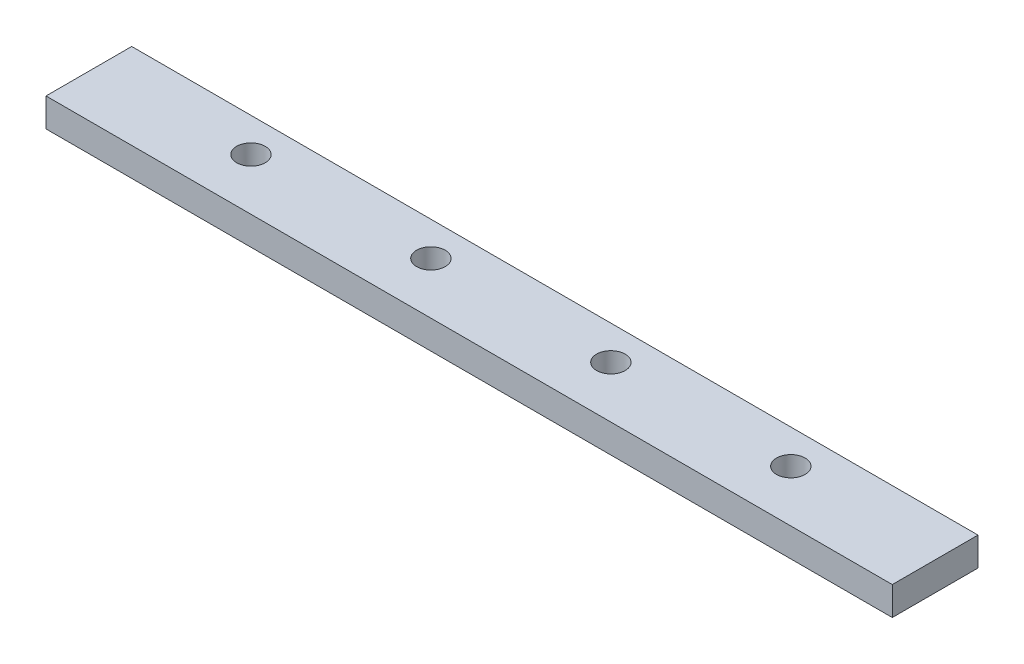
ISO-10303-21;
HEADER;
FILE_DESCRIPTION(('STEP AP214'),'2;1');
FILE_NAME('part.step','',(''),(''),'','','');
FILE_SCHEMA(('AUTOMOTIVE_DESIGN { 1 0 10303 214 1 1 1 1 }'));
ENDSEC;
DATA;
#1=APPLICATION_CONTEXT('core data for automotive mechanical design processes');
#2=APPLICATION_PROTOCOL_DEFINITION('international standard','automotive_design',2000,#1);
#3=PRODUCT_CONTEXT('',#1,'mechanical');
#4=PRODUCT('Part','Part','',(#3));
#5=PRODUCT_RELATED_PRODUCT_CATEGORY('part','',(#4));
#6=PRODUCT_DEFINITION_FORMATION('','',#4);
#7=PRODUCT_DEFINITION_CONTEXT('part definition',#1,'design');
#8=PRODUCT_DEFINITION('design','',#6,#7);
#9=PRODUCT_DEFINITION_SHAPE('','',#8);
#10=(LENGTH_UNIT() NAMED_UNIT(*) SI_UNIT(.MILLI.,.METRE.));
#11=(NAMED_UNIT(*) PLANE_ANGLE_UNIT() SI_UNIT($,.RADIAN.));
#12=(NAMED_UNIT(*) SI_UNIT($,.STERADIAN.) SOLID_ANGLE_UNIT());
#13=UNCERTAINTY_MEASURE_WITH_UNIT(LENGTH_MEASURE(1.E-05),#10,'distance_accuracy_value','');
#14=(GEOMETRIC_REPRESENTATION_CONTEXT(3) GLOBAL_UNCERTAINTY_ASSIGNED_CONTEXT((#13)) GLOBAL_UNIT_ASSIGNED_CONTEXT((#10,
#11,#12)) REPRESENTATION_CONTEXT('',''));
#15=CARTESIAN_POINT('',(0.,0.,0.));
#16=DIRECTION('',(0.,0.,1.));
#17=DIRECTION('',(1.,0.,0.));
#18=AXIS2_PLACEMENT_3D('',#15,#16,#17);
#19=CARTESIAN_POINT('',(376.2,0.,0.));
#20=DIRECTION('',(0.,0.,-1.));
#21=DIRECTION('',(-1.,0.,0.));
#22=AXIS2_PLACEMENT_3D('',#19,#20,#21);
#23=PLANE('',#22);
#24=DIRECTION('',(0.,-1.,0.));
#25=VECTOR('',#24,1.);
#26=CARTESIAN_POINT('',(0.,0.,0.));
#27=LINE('',#26,#25);
#28=CARTESIAN_POINT('',(0.,12.7,0.));
#29=VERTEX_POINT('',#28);
#30=CARTESIAN_POINT('',(0.,0.,0.));
#31=VERTEX_POINT('',#30);
#32=EDGE_CURVE('E106',#29,#31,#27,.T.);
#33=ORIENTED_EDGE('',*,*,#32,.T.);
#34=DIRECTION('',(-1.,0.,0.));
#35=VECTOR('',#34,1.);
#36=CARTESIAN_POINT('',(376.2,0.,0.));
#37=LINE('',#36,#35);
#38=CARTESIAN_POINT('',(376.2,0.,0.));
#39=VERTEX_POINT('',#38);
#40=EDGE_CURVE('E11',#39,#31,#37,.T.);
#41=ORIENTED_EDGE('',*,*,#40,.F.);
#42=DIRECTION('',(0.,-1.,0.));
#43=VECTOR('',#42,1.);
#44=CARTESIAN_POINT('',(376.2,0.,0.));
#45=LINE('',#44,#43);
#46=CARTESIAN_POINT('',(376.2,12.7,0.));
#47=VERTEX_POINT('',#46);
#48=EDGE_CURVE('E93',#47,#39,#45,.T.);
#49=ORIENTED_EDGE('',*,*,#48,.F.);
#50=DIRECTION('',(-1.,0.,0.));
#51=VECTOR('',#50,1.);
#52=CARTESIAN_POINT('',(376.2,12.7,0.));
#53=LINE('',#52,#51);
#54=EDGE_CURVE('E102',#47,#29,#53,.T.);
#55=ORIENTED_EDGE('',*,*,#54,.T.);
#56=EDGE_LOOP('',(#33,#41,#49,#55));
#57=FACE_BOUND('',#56,.T.);
#58=ADVANCED_FACE('F40',(#57),#23,.F.);
#59=CARTESIAN_POINT('',(376.2,0.,0.));
#60=DIRECTION('',(0.,1.,0.));
#61=DIRECTION('',(0.,0.,1.));
#62=AXIS2_PLACEMENT_3D('',#59,#60,#61);
#63=PLANE('',#62);
#64=CARTESIAN_POINT('',(308.1,0.,-23.));
#65=DIRECTION('',(0.,1.,0.));
#66=DIRECTION('',(0.,0.,1.));
#67=AXIS2_PLACEMENT_3D('',#64,#65,#66);
#68=CIRCLE('',#67,6.35);
#69=CARTESIAN_POINT('',(308.1,0.,-16.65));
#70=VERTEX_POINT('',#69);
#71=EDGE_CURVE('E118',#70,#70,#68,.T.);
#72=ORIENTED_EDGE('',*,*,#71,.T.);
#73=EDGE_LOOP('',(#72));
#74=FACE_BOUND('',#73,.T.);
#75=CARTESIAN_POINT('',(228.1,0.,-23.));
#76=DIRECTION('',(0.,1.,0.));
#77=DIRECTION('',(0.,0.,1.));
#78=AXIS2_PLACEMENT_3D('',#75,#76,#77);
#79=CIRCLE('',#78,6.35);
#80=CARTESIAN_POINT('',(228.1,0.,-16.65));
#81=VERTEX_POINT('',#80);
#82=EDGE_CURVE('E231',#81,#81,#79,.T.);
#83=ORIENTED_EDGE('',*,*,#82,.T.);
#84=EDGE_LOOP('',(#83));
#85=FACE_BOUND('',#84,.T.);
#86=CARTESIAN_POINT('',(148.1,0.,-23.));
#87=DIRECTION('',(0.,1.,0.));
#88=DIRECTION('',(0.,0.,1.));
#89=AXIS2_PLACEMENT_3D('',#86,#87,#88);
#90=CIRCLE('',#89,6.35);
#91=CARTESIAN_POINT('',(148.1,0.,-16.65));
#92=VERTEX_POINT('',#91);
#93=EDGE_CURVE('E224',#92,#92,#90,.T.);
#94=ORIENTED_EDGE('',*,*,#93,.T.);
#95=EDGE_LOOP('',(#94));
#96=FACE_BOUND('',#95,.T.);
#97=CARTESIAN_POINT('',(68.1,0.,-23.));
#98=DIRECTION('',(0.,1.,0.));
#99=DIRECTION('',(0.,0.,1.));
#100=AXIS2_PLACEMENT_3D('',#97,#98,#99);
#101=CIRCLE('',#100,6.35);
#102=CARTESIAN_POINT('',(68.1,0.,-16.65));
#103=VERTEX_POINT('',#102);
#104=EDGE_CURVE('E232',#103,#103,#101,.T.);
#105=ORIENTED_EDGE('',*,*,#104,.T.);
#106=EDGE_LOOP('',(#105));
#107=FACE_BOUND('',#106,.T.);
#108=DIRECTION('',(0.,0.,-1.));
#109=VECTOR('',#108,1.);
#110=CARTESIAN_POINT('',(0.,0.,0.));
#111=LINE('',#110,#109);
#112=CARTESIAN_POINT('',(0.,0.,-38.1));
#113=VERTEX_POINT('',#112);
#114=EDGE_CURVE('E97',#31,#113,#111,.T.);
#115=ORIENTED_EDGE('',*,*,#114,.T.);
#116=DIRECTION('',(-1.,0.,0.));
#117=VECTOR('',#116,1.);
#118=CARTESIAN_POINT('',(376.2,0.,-38.1));
#119=LINE('',#118,#117);
#120=CARTESIAN_POINT('',(376.2,0.,-38.1));
#121=VERTEX_POINT('',#120);
#122=EDGE_CURVE('E49',#121,#113,#119,.T.);
#123=ORIENTED_EDGE('',*,*,#122,.F.);
#124=DIRECTION('',(0.,0.,-1.));
#125=VECTOR('',#124,1.);
#126=CARTESIAN_POINT('',(376.2,0.,0.));
#127=LINE('',#126,#125);
#128=EDGE_CURVE('E88',#39,#121,#127,.T.);
#129=ORIENTED_EDGE('',*,*,#128,.F.);
#130=ORIENTED_EDGE('',*,*,#40,.T.);
#131=EDGE_LOOP('',(#115,#123,#129,#130));
#132=FACE_BOUND('',#131,.T.);
#133=ADVANCED_FACE('F96',(#74,#85,#96,#107,#132),#63,.F.);
#134=CARTESIAN_POINT('',(376.2,0.,-38.1));
#135=DIRECTION('',(0.,0.,1.));
#136=DIRECTION('',(0.,-1.,0.));
#137=AXIS2_PLACEMENT_3D('',#134,#135,#136);
#138=PLANE('',#137);
#139=DIRECTION('',(0.,1.,0.));
#140=VECTOR('',#139,1.);
#141=CARTESIAN_POINT('',(0.,0.,-38.1));
#142=LINE('',#141,#140);
#143=CARTESIAN_POINT('',(0.,12.7,-38.1));
#144=VERTEX_POINT('',#143);
#145=EDGE_CURVE('E75',#113,#144,#142,.T.);
#146=ORIENTED_EDGE('',*,*,#145,.T.);
#147=DIRECTION('',(-1.,0.,0.));
#148=VECTOR('',#147,1.);
#149=CARTESIAN_POINT('',(376.2,12.7,-38.1));
#150=LINE('',#149,#148);
#151=CARTESIAN_POINT('',(376.2,12.7,-38.1));
#152=VERTEX_POINT('',#151);
#153=EDGE_CURVE('E98',#152,#144,#150,.T.);
#154=ORIENTED_EDGE('',*,*,#153,.F.);
#155=DIRECTION('',(0.,1.,0.));
#156=VECTOR('',#155,1.);
#157=CARTESIAN_POINT('',(376.2,0.,-38.1));
#158=LINE('',#157,#156);
#159=EDGE_CURVE('E91',#121,#152,#158,.T.);
#160=ORIENTED_EDGE('',*,*,#159,.F.);
#161=ORIENTED_EDGE('',*,*,#122,.T.);
#162=EDGE_LOOP('',(#146,#154,#160,#161));
#163=FACE_BOUND('',#162,.T.);
#164=ADVANCED_FACE('F100',(#163),#138,.F.);
#165=CARTESIAN_POINT('',(376.2,12.7,0.));
#166=DIRECTION('',(0.,-1.,0.));
#167=DIRECTION('',(0.,0.,-1.));
#168=AXIS2_PLACEMENT_3D('',#165,#166,#167);
#169=PLANE('',#168);
#170=CARTESIAN_POINT('',(308.1,12.7,-23.));
#171=DIRECTION('',(0.,-1.,0.));
#172=DIRECTION('',(0.,0.,-1.));
#173=AXIS2_PLACEMENT_3D('',#170,#171,#172);
#174=CIRCLE('',#173,6.35);
#175=CARTESIAN_POINT('',(308.1,12.7,-29.35));
#176=VERTEX_POINT('',#175);
#177=EDGE_CURVE('E43',#176,#176,#174,.T.);
#178=ORIENTED_EDGE('',*,*,#177,.T.);
#179=EDGE_LOOP('',(#178));
#180=FACE_BOUND('',#179,.T.);
#181=CARTESIAN_POINT('',(228.1,12.7,-23.));
#182=DIRECTION('',(0.,-1.,0.));
#183=DIRECTION('',(0.,0.,-1.));
#184=AXIS2_PLACEMENT_3D('',#181,#182,#183);
#185=CIRCLE('',#184,6.35);
#186=CARTESIAN_POINT('',(228.1,12.7,-29.35));
#187=VERTEX_POINT('',#186);
#188=EDGE_CURVE('E120',#187,#187,#185,.T.);
#189=ORIENTED_EDGE('',*,*,#188,.T.);
#190=EDGE_LOOP('',(#189));
#191=FACE_BOUND('',#190,.T.);
#192=CARTESIAN_POINT('',(148.1,12.7,-23.));
#193=DIRECTION('',(0.,-1.,0.));
#194=DIRECTION('',(0.,0.,-1.));
#195=AXIS2_PLACEMENT_3D('',#192,#193,#194);
#196=CIRCLE('',#195,6.35);
#197=CARTESIAN_POINT('',(148.1,12.7,-29.35));
#198=VERTEX_POINT('',#197);
#199=EDGE_CURVE('E117',#198,#198,#196,.T.);
#200=ORIENTED_EDGE('',*,*,#199,.T.);
#201=EDGE_LOOP('',(#200));
#202=FACE_BOUND('',#201,.T.);
#203=CARTESIAN_POINT('',(68.1,12.7,-23.));
#204=DIRECTION('',(0.,-1.,0.));
#205=DIRECTION('',(0.,0.,-1.));
#206=AXIS2_PLACEMENT_3D('',#203,#204,#205);
#207=CIRCLE('',#206,6.35);
#208=CARTESIAN_POINT('',(68.1,12.7,-29.35));
#209=VERTEX_POINT('',#208);
#210=EDGE_CURVE('E114',#209,#209,#207,.T.);
#211=ORIENTED_EDGE('',*,*,#210,.T.);
#212=EDGE_LOOP('',(#211));
#213=FACE_BOUND('',#212,.T.);
#214=DIRECTION('',(0.,0.,1.));
#215=VECTOR('',#214,1.);
#216=CARTESIAN_POINT('',(0.,12.7,0.));
#217=LINE('',#216,#215);
#218=EDGE_CURVE('E81',#144,#29,#217,.T.);
#219=ORIENTED_EDGE('',*,*,#218,.T.);
#220=ORIENTED_EDGE('',*,*,#54,.F.);
#221=DIRECTION('',(0.,0.,1.));
#222=VECTOR('',#221,1.);
#223=CARTESIAN_POINT('',(376.2,12.7,0.));
#224=LINE('',#223,#222);
#225=EDGE_CURVE('E58',#152,#47,#224,.T.);
#226=ORIENTED_EDGE('',*,*,#225,.F.);
#227=ORIENTED_EDGE('',*,*,#153,.T.);
#228=EDGE_LOOP('',(#219,#220,#226,#227));
#229=FACE_BOUND('',#228,.T.);
#230=ADVANCED_FACE('F127',(#180,#191,#202,#213,#229),#169,.F.);
#231=CARTESIAN_POINT('',(376.2,0.,0.));
#232=DIRECTION('',(-1.,0.,0.));
#233=DIRECTION('',(0.,0.,1.));
#234=AXIS2_PLACEMENT_3D('',#231,#232,#233);
#235=PLANE('',#234);
#236=ORIENTED_EDGE('',*,*,#48,.T.);
#237=ORIENTED_EDGE('',*,*,#128,.T.);
#238=ORIENTED_EDGE('',*,*,#159,.T.);
#239=ORIENTED_EDGE('',*,*,#225,.T.);
#240=EDGE_LOOP('',(#236,#237,#238,#239));
#241=FACE_BOUND('',#240,.T.);
#242=ADVANCED_FACE('F89',(#241),#235,.F.);
#243=CARTESIAN_POINT('',(0.,0.,0.));
#244=DIRECTION('',(-1.,0.,0.));
#245=DIRECTION('',(0.,0.,1.));
#246=AXIS2_PLACEMENT_3D('',#243,#244,#245);
#247=PLANE('',#246);
#248=ORIENTED_EDGE('',*,*,#32,.F.);
#249=ORIENTED_EDGE('',*,*,#218,.F.);
#250=ORIENTED_EDGE('',*,*,#145,.F.);
#251=ORIENTED_EDGE('',*,*,#114,.F.);
#252=EDGE_LOOP('',(#248,#249,#250,#251));
#253=FACE_BOUND('',#252,.T.);
#254=ADVANCED_FACE('F149',(#253),#247,.T.);
#255=CARTESIAN_POINT('',(68.1,0.,-23.));
#256=DIRECTION('',(0.,1.,0.));
#257=DIRECTION('',(0.,0.,1.));
#258=AXIS2_PLACEMENT_3D('',#255,#256,#257);
#259=CYLINDRICAL_SURFACE('',#258,6.35);
#260=ORIENTED_EDGE('',*,*,#104,.F.);
#261=EDGE_LOOP('',(#260));
#262=FACE_BOUND('',#261,.T.);
#263=ORIENTED_EDGE('',*,*,#210,.F.);
#264=EDGE_LOOP('',(#263));
#265=FACE_BOUND('',#264,.T.);
#266=ADVANCED_FACE('F151',(#262,#265),#259,.F.);
#267=CARTESIAN_POINT('',(148.1,0.,-23.));
#268=DIRECTION('',(0.,1.,0.));
#269=DIRECTION('',(0.,0.,1.));
#270=AXIS2_PLACEMENT_3D('',#267,#268,#269);
#271=CYLINDRICAL_SURFACE('',#270,6.35);
#272=ORIENTED_EDGE('',*,*,#93,.F.);
#273=EDGE_LOOP('',(#272));
#274=FACE_BOUND('',#273,.T.);
#275=ORIENTED_EDGE('',*,*,#199,.F.);
#276=EDGE_LOOP('',(#275));
#277=FACE_BOUND('',#276,.T.);
#278=ADVANCED_FACE('F137',(#274,#277),#271,.F.);
#279=CARTESIAN_POINT('',(228.1,0.,-23.));
#280=DIRECTION('',(0.,1.,0.));
#281=DIRECTION('',(0.,0.,1.));
#282=AXIS2_PLACEMENT_3D('',#279,#280,#281);
#283=CYLINDRICAL_SURFACE('',#282,6.35);
#284=ORIENTED_EDGE('',*,*,#82,.F.);
#285=EDGE_LOOP('',(#284));
#286=FACE_BOUND('',#285,.T.);
#287=ORIENTED_EDGE('',*,*,#188,.F.);
#288=EDGE_LOOP('',(#287));
#289=FACE_BOUND('',#288,.T.);
#290=ADVANCED_FACE('F131',(#286,#289),#283,.F.);
#291=CARTESIAN_POINT('',(308.1,0.,-23.));
#292=DIRECTION('',(0.,1.,0.));
#293=DIRECTION('',(0.,0.,1.));
#294=AXIS2_PLACEMENT_3D('',#291,#292,#293);
#295=CYLINDRICAL_SURFACE('',#294,6.35);
#296=ORIENTED_EDGE('',*,*,#71,.F.);
#297=EDGE_LOOP('',(#296));
#298=FACE_BOUND('',#297,.T.);
#299=ORIENTED_EDGE('',*,*,#177,.F.);
#300=EDGE_LOOP('',(#299));
#301=FACE_BOUND('',#300,.T.);
#302=ADVANCED_FACE('F129',(#298,#301),#295,.F.);
#303=CLOSED_SHELL('',(#58,#133,#164,#230,#242,#254,#266,#278,#290,#302));
#304=MANIFOLD_SOLID_BREP('B2',#303);
#305=ADVANCED_BREP_SHAPE_REPRESENTATION('',(#18,#304),#14);
#306=SHAPE_DEFINITION_REPRESENTATION(#9,#305);
ENDSEC;
END-ISO-10303-21;
